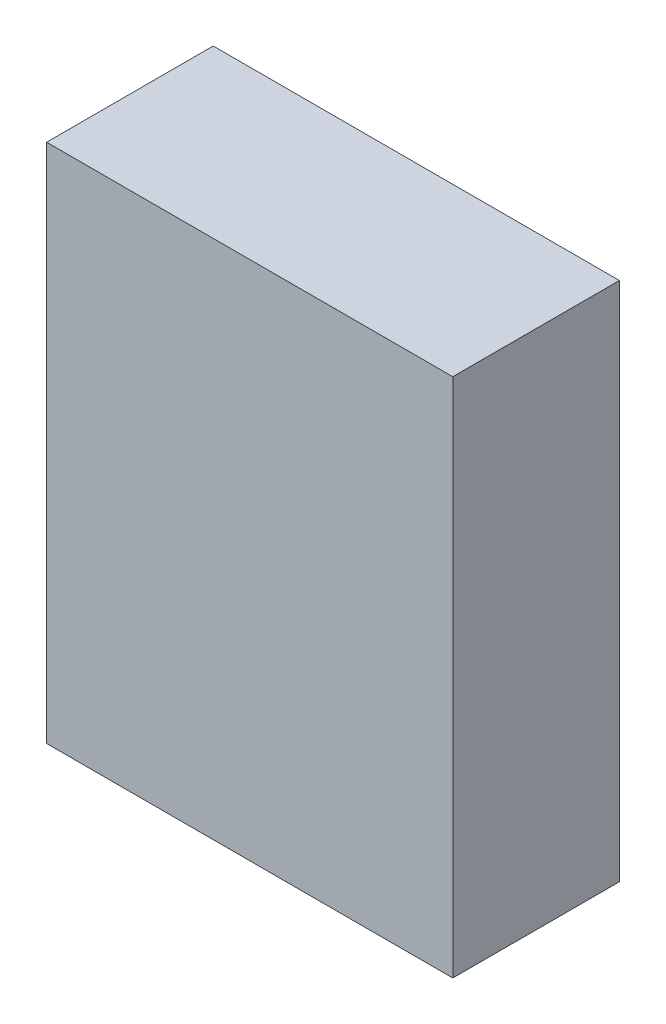
ISO-10303-21;
HEADER;
FILE_DESCRIPTION(('STEP AP214'),'2;1');
FILE_NAME('part.step','',(''),(''),'','','');
FILE_SCHEMA(('AUTOMOTIVE_DESIGN { 1 0 10303 214 1 1 1 1 }'));
ENDSEC;
DATA;
#1=APPLICATION_CONTEXT('core data for automotive mechanical design processes');
#2=APPLICATION_PROTOCOL_DEFINITION('international standard','automotive_design',2000,#1);
#3=PRODUCT_CONTEXT('',#1,'mechanical');
#4=PRODUCT('Part','Part','',(#3));
#5=PRODUCT_RELATED_PRODUCT_CATEGORY('part','',(#4));
#6=PRODUCT_DEFINITION_FORMATION('','',#4);
#7=PRODUCT_DEFINITION_CONTEXT('part definition',#1,'design');
#8=PRODUCT_DEFINITION('design','',#6,#7);
#9=PRODUCT_DEFINITION_SHAPE('','',#8);
#10=(LENGTH_UNIT() NAMED_UNIT(*) SI_UNIT(.MILLI.,.METRE.));
#11=(NAMED_UNIT(*) PLANE_ANGLE_UNIT() SI_UNIT($,.RADIAN.));
#12=(NAMED_UNIT(*) SI_UNIT($,.STERADIAN.) SOLID_ANGLE_UNIT());
#13=UNCERTAINTY_MEASURE_WITH_UNIT(LENGTH_MEASURE(1.E-05),#10,'distance_accuracy_value','');
#14=(GEOMETRIC_REPRESENTATION_CONTEXT(3) GLOBAL_UNCERTAINTY_ASSIGNED_CONTEXT((#13)) GLOBAL_UNIT_ASSIGNED_CONTEXT((#10,
#11,#12)) REPRESENTATION_CONTEXT('',''));
#15=CARTESIAN_POINT('',(0.,0.,0.));
#16=DIRECTION('',(0.,0.,1.));
#17=DIRECTION('',(1.,0.,0.));
#18=AXIS2_PLACEMENT_3D('',#15,#16,#17);
#19=CARTESIAN_POINT('',(0.,0.,40.64));
#20=DIRECTION('',(1.,0.,0.));
#21=DIRECTION('',(0.,0.,-1.));
#22=AXIS2_PLACEMENT_3D('',#19,#20,#21);
#23=PLANE('',#22);
#24=DIRECTION('',(0.,-1.,0.));
#25=VECTOR('',#24,1.);
#26=CARTESIAN_POINT('',(0.,0.,0.));
#27=LINE('',#26,#25);
#28=CARTESIAN_POINT('',(0.,127.,0.));
#29=VERTEX_POINT('',#28);
#30=CARTESIAN_POINT('',(0.,0.,0.));
#31=VERTEX_POINT('',#30);
#32=EDGE_CURVE('E105',#29,#31,#27,.T.);
#33=ORIENTED_EDGE('',*,*,#32,.T.);
#34=DIRECTION('',(0.,0.,-1.));
#35=VECTOR('',#34,1.);
#36=CARTESIAN_POINT('',(0.,0.,40.64));
#37=LINE('',#36,#35);
#38=CARTESIAN_POINT('',(0.,0.,40.64));
#39=VERTEX_POINT('',#38);
#40=EDGE_CURVE('E11',#39,#31,#37,.T.);
#41=ORIENTED_EDGE('',*,*,#40,.F.);
#42=DIRECTION('',(0.,-1.,0.));
#43=VECTOR('',#42,1.);
#44=CARTESIAN_POINT('',(0.,0.,40.64));
#45=LINE('',#44,#43);
#46=CARTESIAN_POINT('',(0.,127.,40.64));
#47=VERTEX_POINT('',#46);
#48=EDGE_CURVE('E89',#47,#39,#45,.T.);
#49=ORIENTED_EDGE('',*,*,#48,.F.);
#50=DIRECTION('',(0.,0.,-1.));
#51=VECTOR('',#50,1.);
#52=CARTESIAN_POINT('',(0.,127.,40.64));
#53=LINE('',#52,#51);
#54=EDGE_CURVE('E98',#47,#29,#53,.T.);
#55=ORIENTED_EDGE('',*,*,#54,.T.);
#56=EDGE_LOOP('',(#33,#41,#49,#55));
#57=FACE_BOUND('',#56,.T.);
#58=ADVANCED_FACE('F39',(#57),#23,.F.);
#59=CARTESIAN_POINT('',(0.,0.,40.64));
#60=DIRECTION('',(0.,1.,0.));
#61=DIRECTION('',(0.,0.,1.));
#62=AXIS2_PLACEMENT_3D('',#59,#60,#61);
#63=PLANE('',#62);
#64=DIRECTION('',(1.,0.,0.));
#65=VECTOR('',#64,1.);
#66=CARTESIAN_POINT('',(0.,0.,0.));
#67=LINE('',#66,#65);
#68=CARTESIAN_POINT('',(99.06,0.,0.));
#69=VERTEX_POINT('',#68);
#70=EDGE_CURVE('E94',#31,#69,#67,.T.);
#71=ORIENTED_EDGE('',*,*,#70,.T.);
#72=DIRECTION('',(0.,0.,-1.));
#73=VECTOR('',#72,1.);
#74=CARTESIAN_POINT('',(99.06,0.,40.64));
#75=LINE('',#74,#73);
#76=CARTESIAN_POINT('',(99.06,0.,40.64));
#77=VERTEX_POINT('',#76);
#78=EDGE_CURVE('E50',#77,#69,#75,.T.);
#79=ORIENTED_EDGE('',*,*,#78,.F.);
#80=DIRECTION('',(1.,0.,0.));
#81=VECTOR('',#80,1.);
#82=CARTESIAN_POINT('',(0.,0.,40.64));
#83=LINE('',#82,#81);
#84=EDGE_CURVE('E83',#39,#77,#83,.T.);
#85=ORIENTED_EDGE('',*,*,#84,.F.);
#86=ORIENTED_EDGE('',*,*,#40,.T.);
#87=EDGE_LOOP('',(#71,#79,#85,#86));
#88=FACE_BOUND('',#87,.T.);
#89=ADVANCED_FACE('F91',(#88),#63,.F.);
#90=CARTESIAN_POINT('',(99.06,0.,40.64));
#91=DIRECTION('',(-1.,0.,0.));
#92=DIRECTION('',(0.,0.,1.));
#93=AXIS2_PLACEMENT_3D('',#90,#91,#92);
#94=PLANE('',#93);
#95=DIRECTION('',(0.,1.,0.));
#96=VECTOR('',#95,1.);
#97=CARTESIAN_POINT('',(99.06,0.,0.));
#98=LINE('',#97,#96);
#99=CARTESIAN_POINT('',(99.06,127.,0.));
#100=VERTEX_POINT('',#99);
#101=EDGE_CURVE('E75',#69,#100,#98,.T.);
#102=ORIENTED_EDGE('',*,*,#101,.T.);
#103=DIRECTION('',(0.,0.,-1.));
#104=VECTOR('',#103,1.);
#105=CARTESIAN_POINT('',(99.06,127.,40.64));
#106=LINE('',#105,#104);
#107=CARTESIAN_POINT('',(99.06,127.,40.64));
#108=VERTEX_POINT('',#107);
#109=EDGE_CURVE('E92',#108,#100,#106,.T.);
#110=ORIENTED_EDGE('',*,*,#109,.F.);
#111=DIRECTION('',(0.,1.,0.));
#112=VECTOR('',#111,1.);
#113=CARTESIAN_POINT('',(99.06,0.,40.64));
#114=LINE('',#113,#112);
#115=EDGE_CURVE('E86',#77,#108,#114,.T.);
#116=ORIENTED_EDGE('',*,*,#115,.F.);
#117=ORIENTED_EDGE('',*,*,#78,.T.);
#118=EDGE_LOOP('',(#102,#110,#116,#117));
#119=FACE_BOUND('',#118,.T.);
#120=ADVANCED_FACE('F96',(#119),#94,.F.);
#121=CARTESIAN_POINT('',(0.,127.,40.64));
#122=DIRECTION('',(0.,-1.,0.));
#123=DIRECTION('',(0.,0.,-1.));
#124=AXIS2_PLACEMENT_3D('',#121,#122,#123);
#125=PLANE('',#124);
#126=DIRECTION('',(-1.,0.,0.));
#127=VECTOR('',#126,1.);
#128=CARTESIAN_POINT('',(0.,127.,0.));
#129=LINE('',#128,#127);
#130=EDGE_CURVE('E79',#100,#29,#129,.T.);
#131=ORIENTED_EDGE('',*,*,#130,.T.);
#132=ORIENTED_EDGE('',*,*,#54,.F.);
#133=DIRECTION('',(-1.,0.,0.));
#134=VECTOR('',#133,1.);
#135=CARTESIAN_POINT('',(0.,127.,40.64));
#136=LINE('',#135,#134);
#137=EDGE_CURVE('E54',#108,#47,#136,.T.);
#138=ORIENTED_EDGE('',*,*,#137,.F.);
#139=ORIENTED_EDGE('',*,*,#109,.T.);
#140=EDGE_LOOP('',(#131,#132,#138,#139));
#141=FACE_BOUND('',#140,.T.);
#142=ADVANCED_FACE('F108',(#141),#125,.F.);
#143=CARTESIAN_POINT('',(0.,0.,40.64));
#144=DIRECTION('',(0.,0.,-1.));
#145=DIRECTION('',(-1.,0.,0.));
#146=AXIS2_PLACEMENT_3D('',#143,#144,#145);
#147=PLANE('',#146);
#148=ORIENTED_EDGE('',*,*,#48,.T.);
#149=ORIENTED_EDGE('',*,*,#84,.T.);
#150=ORIENTED_EDGE('',*,*,#115,.T.);
#151=ORIENTED_EDGE('',*,*,#137,.T.);
#152=EDGE_LOOP('',(#148,#149,#150,#151));
#153=FACE_BOUND('',#152,.T.);
#154=ADVANCED_FACE('F88',(#153),#147,.F.);
#155=CARTESIAN_POINT('',(0.,0.,0.));
#156=DIRECTION('',(0.,0.,-1.));
#157=DIRECTION('',(-1.,0.,0.));
#158=AXIS2_PLACEMENT_3D('',#155,#156,#157);
#159=PLANE('',#158);
#160=ORIENTED_EDGE('',*,*,#32,.F.);
#161=ORIENTED_EDGE('',*,*,#130,.F.);
#162=ORIENTED_EDGE('',*,*,#101,.F.);
#163=ORIENTED_EDGE('',*,*,#70,.F.);
#164=EDGE_LOOP('',(#160,#161,#162,#163));
#165=FACE_BOUND('',#164,.T.);
#166=ADVANCED_FACE('F115',(#165),#159,.T.);
#167=CLOSED_SHELL('',(#58,#89,#120,#142,#154,#166));
#168=MANIFOLD_SOLID_BREP('B2',#167);
#169=ADVANCED_BREP_SHAPE_REPRESENTATION('',(#18,#168),#14);
#170=SHAPE_DEFINITION_REPRESENTATION(#9,#169);
ENDSEC;
END-ISO-10303-21;
